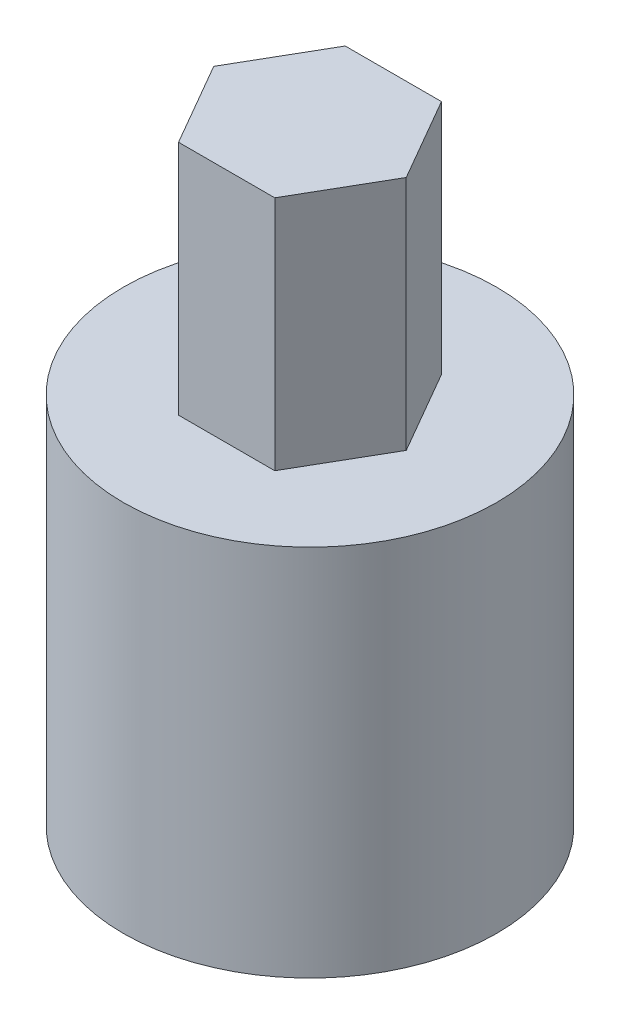
ISO-10303-21;
HEADER;
FILE_DESCRIPTION(('STEP AP214'),'2;1');
FILE_NAME('part.step','',(''),(''),'','','');
FILE_SCHEMA(('AUTOMOTIVE_DESIGN { 1 0 10303 214 1 1 1 1 }'));
ENDSEC;
DATA;
#1=APPLICATION_CONTEXT('core data for automotive mechanical design processes');
#2=APPLICATION_PROTOCOL_DEFINITION('international standard','automotive_design',2000,#1);
#3=PRODUCT_CONTEXT('',#1,'mechanical');
#4=PRODUCT('Part','Part','',(#3));
#5=PRODUCT_RELATED_PRODUCT_CATEGORY('part','',(#4));
#6=PRODUCT_DEFINITION_FORMATION('','',#4);
#7=PRODUCT_DEFINITION_CONTEXT('part definition',#1,'design');
#8=PRODUCT_DEFINITION('design','',#6,#7);
#9=PRODUCT_DEFINITION_SHAPE('','',#8);
#10=(LENGTH_UNIT() NAMED_UNIT(*) SI_UNIT(.MILLI.,.METRE.));
#11=(NAMED_UNIT(*) PLANE_ANGLE_UNIT() SI_UNIT($,.RADIAN.));
#12=(NAMED_UNIT(*) SI_UNIT($,.STERADIAN.) SOLID_ANGLE_UNIT());
#13=UNCERTAINTY_MEASURE_WITH_UNIT(LENGTH_MEASURE(1.E-05),#10,'distance_accuracy_value','');
#14=(GEOMETRIC_REPRESENTATION_CONTEXT(3) GLOBAL_UNCERTAINTY_ASSIGNED_CONTEXT((#13)) GLOBAL_UNIT_ASSIGNED_CONTEXT((#10,
#11,#12)) REPRESENTATION_CONTEXT('',''));
#15=CARTESIAN_POINT('',(0.,0.,0.));
#16=DIRECTION('',(0.,0.,1.));
#17=DIRECTION('',(1.,0.,0.));
#18=AXIS2_PLACEMENT_3D('',#15,#16,#17);
#19=CARTESIAN_POINT('',(0.,0.,0.));
#20=DIRECTION('',(0.,1.,0.));
#21=DIRECTION('',(0.,0.,1.));
#22=AXIS2_PLACEMENT_3D('',#19,#20,#21);
#23=PLANE('',#22);
#24=CARTESIAN_POINT('',(0.,0.,0.));
#25=DIRECTION('',(0.,1.,0.));
#26=DIRECTION('',(0.,0.,1.));
#27=AXIS2_PLACEMENT_3D('',#24,#25,#26);
#28=CIRCLE('',#27,7.5);
#29=CARTESIAN_POINT('',(0.,0.,7.5));
#30=VERTEX_POINT('',#29);
#31=EDGE_CURVE('E45',#30,#30,#28,.T.);
#32=ORIENTED_EDGE('',*,*,#31,.F.);
#33=EDGE_LOOP('',(#32));
#34=FACE_BOUND('',#33,.T.);
#35=DIRECTION('',(1.,0.,0.));
#36=VECTOR('',#35,1.);
#37=CARTESIAN_POINT('',(0.,0.,2.627));
#38=LINE('',#37,#36);
#39=CARTESIAN_POINT('',(-1.69617216107328,0.,2.627));
#40=VERTEX_POINT('',#39);
#41=CARTESIAN_POINT('',(1.69617216107328,0.,2.627));
#42=VERTEX_POINT('',#41);
#43=EDGE_CURVE('E56',#40,#42,#38,.T.);
#44=ORIENTED_EDGE('',*,*,#43,.T.);
#45=CARTESIAN_POINT('',(0.,0.,0.));
#46=DIRECTION('',(0.,-1.,0.));
#47=DIRECTION('',(0.,0.,-1.));
#48=AXIS2_PLACEMENT_3D('',#45,#46,#47);
#49=CIRCLE('',#48,3.127);
#50=EDGE_CURVE('E118',#40,#42,#49,.T.);
#51=ORIENTED_EDGE('',*,*,#50,.F.);
#52=EDGE_LOOP('',(#44,#51));
#53=FACE_BOUND('',#52,.T.);
#54=ADVANCED_FACE('F41',(#34,#53),#23,.F.);
#55=CARTESIAN_POINT('',(0.,15.,0.));
#56=DIRECTION('',(0.,-1.,0.));
#57=DIRECTION('',(0.,0.,-1.));
#58=AXIS2_PLACEMENT_3D('',#55,#56,#57);
#59=CYLINDRICAL_SURFACE('',#58,7.5);
#60=CARTESIAN_POINT('',(0.,15.,0.));
#61=DIRECTION('',(0.,1.,0.));
#62=DIRECTION('',(0.,0.,1.));
#63=AXIS2_PLACEMENT_3D('',#60,#61,#62);
#64=CIRCLE('',#63,7.5);
#65=CARTESIAN_POINT('',(0.,15.,7.5));
#66=VERTEX_POINT('',#65);
#67=EDGE_CURVE('E11',#66,#66,#64,.T.);
#68=ORIENTED_EDGE('',*,*,#67,.F.);
#69=EDGE_LOOP('',(#68));
#70=FACE_BOUND('',#69,.T.);
#71=ORIENTED_EDGE('',*,*,#31,.T.);
#72=EDGE_LOOP('',(#71));
#73=FACE_BOUND('',#72,.T.);
#74=ADVANCED_FACE('F43',(#70,#73),#59,.T.);
#75=CARTESIAN_POINT('',(0.,15.,0.));
#76=DIRECTION('',(0.,1.,0.));
#77=DIRECTION('',(0.,0.,1.));
#78=AXIS2_PLACEMENT_3D('',#75,#76,#77);
#79=PLANE('',#78);
#80=DIRECTION('',(-0.5,0.,-0.866025403784439));
#81=VECTOR('',#80,1.);
#82=CARTESIAN_POINT('',(3.86824680357049,15.,0.));
#83=LINE('',#82,#81);
#84=CARTESIAN_POINT('',(3.86824680357049,15.,0.));
#85=VERTEX_POINT('',#84);
#86=CARTESIAN_POINT('',(1.93412340178525,15.,-3.35));
#87=VERTEX_POINT('',#86);
#88=EDGE_CURVE('E64',#85,#87,#83,.T.);
#89=ORIENTED_EDGE('',*,*,#88,.F.);
#90=DIRECTION('',(0.5,0.,-0.866025403784439));
#91=VECTOR('',#90,1.);
#92=CARTESIAN_POINT('',(1.93412340178525,15.,3.35));
#93=LINE('',#92,#91);
#94=CARTESIAN_POINT('',(1.93412340178525,15.,3.35));
#95=VERTEX_POINT('',#94);
#96=EDGE_CURVE('E130',#95,#85,#93,.T.);
#97=ORIENTED_EDGE('',*,*,#96,.F.);
#98=DIRECTION('',(1.,0.,0.));
#99=VECTOR('',#98,1.);
#100=CARTESIAN_POINT('',(-1.93412340178525,15.,3.35));
#101=LINE('',#100,#99);
#102=CARTESIAN_POINT('',(-1.93412340178525,15.,3.35));
#103=VERTEX_POINT('',#102);
#104=EDGE_CURVE('E151',#103,#95,#101,.T.);
#105=ORIENTED_EDGE('',*,*,#104,.F.);
#106=DIRECTION('',(0.5,0.,0.866025403784439));
#107=VECTOR('',#106,1.);
#108=CARTESIAN_POINT('',(-3.86824680357049,15.,0.));
#109=LINE('',#108,#107);
#110=CARTESIAN_POINT('',(-3.86824680357049,15.,0.));
#111=VERTEX_POINT('',#110);
#112=EDGE_CURVE('E148',#111,#103,#109,.T.);
#113=ORIENTED_EDGE('',*,*,#112,.F.);
#114=DIRECTION('',(-0.5,0.,0.866025403784439));
#115=VECTOR('',#114,1.);
#116=CARTESIAN_POINT('',(-1.93412340178525,15.,-3.35));
#117=LINE('',#116,#115);
#118=CARTESIAN_POINT('',(-1.93412340178525,15.,-3.35));
#119=VERTEX_POINT('',#118);
#120=EDGE_CURVE('E145',#119,#111,#117,.T.);
#121=ORIENTED_EDGE('',*,*,#120,.F.);
#122=DIRECTION('',(-1.,0.,0.));
#123=VECTOR('',#122,1.);
#124=CARTESIAN_POINT('',(1.93412340178525,15.,-3.35));
#125=LINE('',#124,#123);
#126=EDGE_CURVE('E142',#87,#119,#125,.T.);
#127=ORIENTED_EDGE('',*,*,#126,.F.);
#128=EDGE_LOOP('',(#89,#97,#105,#113,#121,#127));
#129=FACE_BOUND('',#128,.T.);
#130=ORIENTED_EDGE('',*,*,#67,.T.);
#131=EDGE_LOOP('',(#130));
#132=FACE_BOUND('',#131,.T.);
#133=ADVANCED_FACE('F182',(#129,#132),#79,.T.);
#134=CARTESIAN_POINT('',(3.86824680357049,24.5,0.));
#135=DIRECTION('',(-0.866025403784438,0.,0.5));
#136=DIRECTION('',(0.5,0.,0.866025403784439));
#137=AXIS2_PLACEMENT_3D('',#134,#135,#136);
#138=PLANE('',#137);
#139=ORIENTED_EDGE('',*,*,#88,.T.);
#140=DIRECTION('',(0.,-1.,0.));
#141=VECTOR('',#140,1.);
#142=CARTESIAN_POINT('',(1.93412340178525,24.5,-3.35));
#143=LINE('',#142,#141);
#144=CARTESIAN_POINT('',(1.93412340178525,24.5,-3.35));
#145=VERTEX_POINT('',#144);
#146=EDGE_CURVE('E169',#145,#87,#143,.T.);
#147=ORIENTED_EDGE('',*,*,#146,.F.);
#148=DIRECTION('',(-0.5,0.,-0.866025403784439));
#149=VECTOR('',#148,1.);
#150=CARTESIAN_POINT('',(3.86824680357049,24.5,0.));
#151=LINE('',#150,#149);
#152=CARTESIAN_POINT('',(3.86824680357049,24.5,0.));
#153=VERTEX_POINT('',#152);
#154=EDGE_CURVE('E126',#153,#145,#151,.T.);
#155=ORIENTED_EDGE('',*,*,#154,.F.);
#156=DIRECTION('',(0.,-1.,0.));
#157=VECTOR('',#156,1.);
#158=CARTESIAN_POINT('',(3.86824680357049,24.5,0.));
#159=LINE('',#158,#157);
#160=EDGE_CURVE('E140',#153,#85,#159,.T.);
#161=ORIENTED_EDGE('',*,*,#160,.T.);
#162=EDGE_LOOP('',(#139,#147,#155,#161));
#163=FACE_BOUND('',#162,.T.);
#164=ADVANCED_FACE('F187',(#163),#138,.F.);
#165=CARTESIAN_POINT('',(1.93412340178525,24.5,-3.35));
#166=DIRECTION('',(0.,0.,1.));
#167=DIRECTION('',(1.,0.,0.));
#168=AXIS2_PLACEMENT_3D('',#165,#166,#167);
#169=PLANE('',#168);
#170=ORIENTED_EDGE('',*,*,#126,.T.);
#171=DIRECTION('',(0.,-1.,0.));
#172=VECTOR('',#171,1.);
#173=CARTESIAN_POINT('',(-1.93412340178525,24.5,-3.35));
#174=LINE('',#173,#172);
#175=CARTESIAN_POINT('',(-1.93412340178525,24.5,-3.35));
#176=VERTEX_POINT('',#175);
#177=EDGE_CURVE('E166',#176,#119,#174,.T.);
#178=ORIENTED_EDGE('',*,*,#177,.F.);
#179=DIRECTION('',(-1.,0.,0.));
#180=VECTOR('',#179,1.);
#181=CARTESIAN_POINT('',(1.93412340178525,24.5,-3.35));
#182=LINE('',#181,#180);
#183=EDGE_CURVE('E129',#145,#176,#182,.T.);
#184=ORIENTED_EDGE('',*,*,#183,.F.);
#185=ORIENTED_EDGE('',*,*,#146,.T.);
#186=EDGE_LOOP('',(#170,#178,#184,#185));
#187=FACE_BOUND('',#186,.T.);
#188=ADVANCED_FACE('F190',(#187),#169,.F.);
#189=CARTESIAN_POINT('',(-1.93412340178525,24.5,-3.35));
#190=DIRECTION('',(0.866025403784439,0.,0.5));
#191=DIRECTION('',(0.5,0.,-0.866025403784439));
#192=AXIS2_PLACEMENT_3D('',#189,#190,#191);
#193=PLANE('',#192);
#194=ORIENTED_EDGE('',*,*,#120,.T.);
#195=DIRECTION('',(0.,-1.,0.));
#196=VECTOR('',#195,1.);
#197=CARTESIAN_POINT('',(-3.86824680357049,24.5,0.));
#198=LINE('',#197,#196);
#199=CARTESIAN_POINT('',(-3.86824680357049,24.5,0.));
#200=VERTEX_POINT('',#199);
#201=EDGE_CURVE('E163',#200,#111,#198,.T.);
#202=ORIENTED_EDGE('',*,*,#201,.F.);
#203=DIRECTION('',(-0.5,0.,0.866025403784439));
#204=VECTOR('',#203,1.);
#205=CARTESIAN_POINT('',(-1.93412340178525,24.5,-3.35));
#206=LINE('',#205,#204);
#207=EDGE_CURVE('E132',#176,#200,#206,.T.);
#208=ORIENTED_EDGE('',*,*,#207,.F.);
#209=ORIENTED_EDGE('',*,*,#177,.T.);
#210=EDGE_LOOP('',(#194,#202,#208,#209));
#211=FACE_BOUND('',#210,.T.);
#212=ADVANCED_FACE('F194',(#211),#193,.F.);
#213=CARTESIAN_POINT('',(-3.86824680357049,24.5,0.));
#214=DIRECTION('',(0.866025403784439,0.,-0.5));
#215=DIRECTION('',(-0.5,0.,-0.866025403784439));
#216=AXIS2_PLACEMENT_3D('',#213,#214,#215);
#217=PLANE('',#216);
#218=ORIENTED_EDGE('',*,*,#112,.T.);
#219=DIRECTION('',(0.,-1.,0.));
#220=VECTOR('',#219,1.);
#221=CARTESIAN_POINT('',(-1.93412340178525,24.5,3.35));
#222=LINE('',#221,#220);
#223=CARTESIAN_POINT('',(-1.93412340178525,24.5,3.35));
#224=VERTEX_POINT('',#223);
#225=EDGE_CURVE('E160',#224,#103,#222,.T.);
#226=ORIENTED_EDGE('',*,*,#225,.F.);
#227=DIRECTION('',(0.5,0.,0.866025403784439));
#228=VECTOR('',#227,1.);
#229=CARTESIAN_POINT('',(-3.86824680357049,24.5,0.));
#230=LINE('',#229,#228);
#231=EDGE_CURVE('E134',#200,#224,#230,.T.);
#232=ORIENTED_EDGE('',*,*,#231,.F.);
#233=ORIENTED_EDGE('',*,*,#201,.T.);
#234=EDGE_LOOP('',(#218,#226,#232,#233));
#235=FACE_BOUND('',#234,.T.);
#236=ADVANCED_FACE('F197',(#235),#217,.F.);
#237=CARTESIAN_POINT('',(-1.93412340178525,24.5,3.35));
#238=DIRECTION('',(0.,0.,-1.));
#239=DIRECTION('',(-1.,0.,0.));
#240=AXIS2_PLACEMENT_3D('',#237,#238,#239);
#241=PLANE('',#240);
#242=ORIENTED_EDGE('',*,*,#104,.T.);
#243=DIRECTION('',(0.,-1.,0.));
#244=VECTOR('',#243,1.);
#245=CARTESIAN_POINT('',(1.93412340178525,24.5,3.35));
#246=LINE('',#245,#244);
#247=CARTESIAN_POINT('',(1.93412340178525,24.5,3.35));
#248=VERTEX_POINT('',#247);
#249=EDGE_CURVE('E157',#248,#95,#246,.T.);
#250=ORIENTED_EDGE('',*,*,#249,.F.);
#251=DIRECTION('',(1.,0.,0.));
#252=VECTOR('',#251,1.);
#253=CARTESIAN_POINT('',(-1.93412340178525,24.5,3.35));
#254=LINE('',#253,#252);
#255=EDGE_CURVE('E136',#224,#248,#254,.T.);
#256=ORIENTED_EDGE('',*,*,#255,.F.);
#257=ORIENTED_EDGE('',*,*,#225,.T.);
#258=EDGE_LOOP('',(#242,#250,#256,#257));
#259=FACE_BOUND('',#258,.T.);
#260=ADVANCED_FACE('F201',(#259),#241,.F.);
#261=CARTESIAN_POINT('',(1.93412340178525,24.5,3.35));
#262=DIRECTION('',(-0.866025403784439,0.,-0.5));
#263=DIRECTION('',(-0.5,0.,0.866025403784439));
#264=AXIS2_PLACEMENT_3D('',#261,#262,#263);
#265=PLANE('',#264);
#266=ORIENTED_EDGE('',*,*,#96,.T.);
#267=ORIENTED_EDGE('',*,*,#160,.F.);
#268=DIRECTION('',(0.5,0.,-0.866025403784439));
#269=VECTOR('',#268,1.);
#270=CARTESIAN_POINT('',(1.93412340178525,24.5,3.35));
#271=LINE('',#270,#269);
#272=EDGE_CURVE('E138',#248,#153,#271,.T.);
#273=ORIENTED_EDGE('',*,*,#272,.F.);
#274=ORIENTED_EDGE('',*,*,#249,.T.);
#275=EDGE_LOOP('',(#266,#267,#273,#274));
#276=FACE_BOUND('',#275,.T.);
#277=ADVANCED_FACE('F205',(#276),#265,.F.);
#278=CARTESIAN_POINT('',(0.,24.5,0.));
#279=DIRECTION('',(0.,1.,0.));
#280=DIRECTION('',(0.,0.,1.));
#281=AXIS2_PLACEMENT_3D('',#278,#279,#280);
#282=PLANE('',#281);
#283=ORIENTED_EDGE('',*,*,#154,.T.);
#284=ORIENTED_EDGE('',*,*,#183,.T.);
#285=ORIENTED_EDGE('',*,*,#207,.T.);
#286=ORIENTED_EDGE('',*,*,#231,.T.);
#287=ORIENTED_EDGE('',*,*,#255,.T.);
#288=ORIENTED_EDGE('',*,*,#272,.T.);
#289=EDGE_LOOP('',(#283,#284,#285,#286,#287,#288));
#290=FACE_BOUND('',#289,.T.);
#291=ADVANCED_FACE('F209',(#290),#282,.T.);
#292=CARTESIAN_POINT('',(0.,12.,2.627));
#293=DIRECTION('',(0.,0.,-1.));
#294=DIRECTION('',(-1.,0.,0.));
#295=AXIS2_PLACEMENT_3D('',#292,#293,#294);
#296=PLANE('',#295);
#297=ORIENTED_EDGE('',*,*,#43,.F.);
#298=DIRECTION('',(0.,-1.,0.));
#299=VECTOR('',#298,1.);
#300=CARTESIAN_POINT('',(-1.69617216107328,12.,2.627));
#301=LINE('',#300,#299);
#302=CARTESIAN_POINT('',(-1.69617216107328,12.,2.627));
#303=VERTEX_POINT('',#302);
#304=EDGE_CURVE('E103',#303,#40,#301,.T.);
#305=ORIENTED_EDGE('',*,*,#304,.F.);
#306=DIRECTION('',(1.,0.,0.));
#307=VECTOR('',#306,1.);
#308=CARTESIAN_POINT('',(0.,12.,2.627));
#309=LINE('',#308,#307);
#310=CARTESIAN_POINT('',(1.69617216107328,12.,2.627));
#311=VERTEX_POINT('',#310);
#312=EDGE_CURVE('E106',#303,#311,#309,.T.);
#313=ORIENTED_EDGE('',*,*,#312,.T.);
#314=DIRECTION('',(0.,-1.,0.));
#315=VECTOR('',#314,1.);
#316=CARTESIAN_POINT('',(1.69617216107328,12.,2.627));
#317=LINE('',#316,#315);
#318=EDGE_CURVE('E112',#311,#42,#317,.T.);
#319=ORIENTED_EDGE('',*,*,#318,.T.);
#320=EDGE_LOOP('',(#297,#305,#313,#319));
#321=FACE_BOUND('',#320,.T.);
#322=ADVANCED_FACE('F105',(#321),#296,.T.);
#323=CARTESIAN_POINT('',(0.,12.,0.));
#324=DIRECTION('',(0.,-1.,0.));
#325=DIRECTION('',(0.,0.,-1.));
#326=AXIS2_PLACEMENT_3D('',#323,#324,#325);
#327=CYLINDRICAL_SURFACE('',#326,3.127);
#328=ORIENTED_EDGE('',*,*,#50,.T.);
#329=ORIENTED_EDGE('',*,*,#318,.F.);
#330=CARTESIAN_POINT('',(0.,12.,0.));
#331=DIRECTION('',(0.,-1.,0.));
#332=DIRECTION('',(0.,0.,-1.));
#333=AXIS2_PLACEMENT_3D('',#330,#331,#332);
#334=CIRCLE('',#333,3.127);
#335=EDGE_CURVE('E113',#303,#311,#334,.T.);
#336=ORIENTED_EDGE('',*,*,#335,.F.);
#337=ORIENTED_EDGE('',*,*,#304,.T.);
#338=EDGE_LOOP('',(#328,#329,#336,#337));
#339=FACE_BOUND('',#338,.T.);
#340=ADVANCED_FACE('F120',(#339),#327,.F.);
#341=CARTESIAN_POINT('',(0.,12.,0.));
#342=DIRECTION('',(0.,-1.,0.));
#343=DIRECTION('',(0.,0.,-1.));
#344=AXIS2_PLACEMENT_3D('',#341,#342,#343);
#345=PLANE('',#344);
#346=ORIENTED_EDGE('',*,*,#312,.F.);
#347=ORIENTED_EDGE('',*,*,#335,.T.);
#348=EDGE_LOOP('',(#346,#347));
#349=FACE_BOUND('',#348,.T.);
#350=ADVANCED_FACE('F117',(#349),#345,.T.);
#351=CLOSED_SHELL('',(#54,#74,#133,#164,#188,#212,#236,#260,#277,#291,#322,#340,#350));
#352=MANIFOLD_SOLID_BREP('B2',#351);
#353=ADVANCED_BREP_SHAPE_REPRESENTATION('',(#18,#352),#14);
#354=SHAPE_DEFINITION_REPRESENTATION(#9,#353);
ENDSEC;
END-ISO-10303-21;
